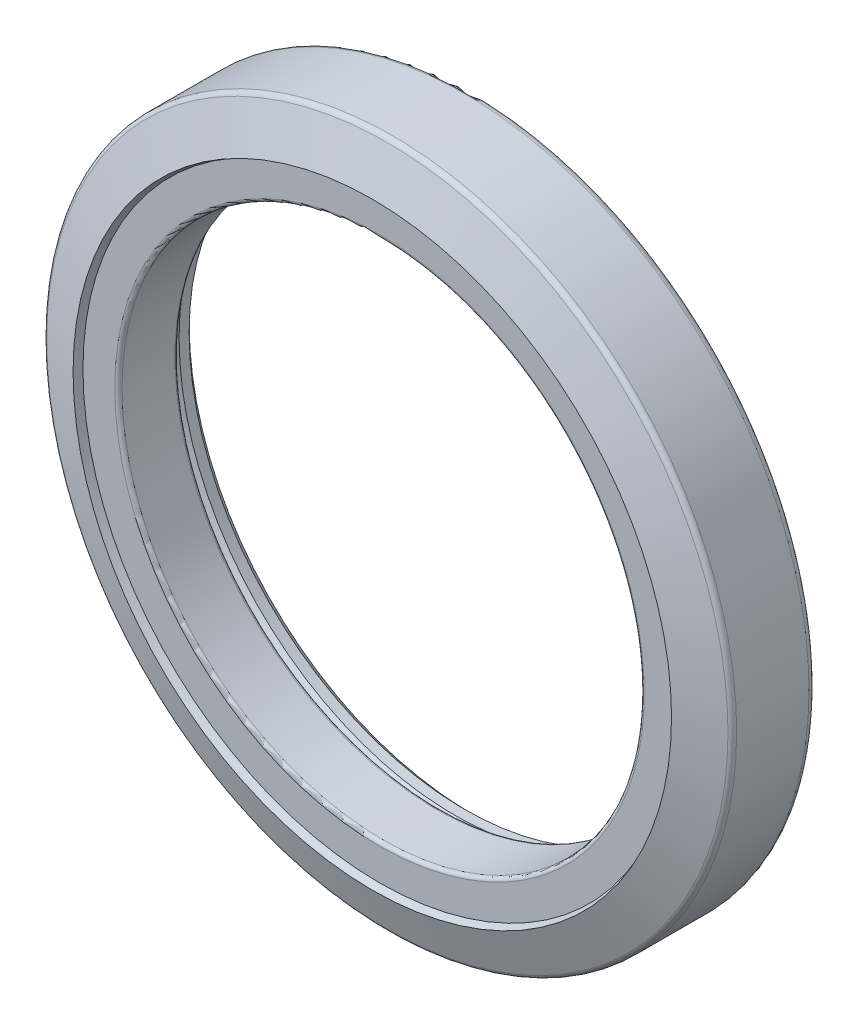
ISO-10303-21;
HEADER;
FILE_DESCRIPTION(('STEP AP214'),'2;1');
FILE_NAME('part.step','',(''),(''),'','','');
FILE_SCHEMA(('AUTOMOTIVE_DESIGN { 1 0 10303 214 1 1 1 1 }'));
ENDSEC;
DATA;
#1=APPLICATION_CONTEXT('core data for automotive mechanical design processes');
#2=APPLICATION_PROTOCOL_DEFINITION('international standard','automotive_design',2000,#1);
#3=PRODUCT_CONTEXT('',#1,'mechanical');
#4=PRODUCT('Part','Part','',(#3));
#5=PRODUCT_RELATED_PRODUCT_CATEGORY('part','',(#4));
#6=PRODUCT_DEFINITION_FORMATION('','',#4);
#7=PRODUCT_DEFINITION_CONTEXT('part definition',#1,'design');
#8=PRODUCT_DEFINITION('design','',#6,#7);
#9=PRODUCT_DEFINITION_SHAPE('','',#8);
#10=(LENGTH_UNIT() NAMED_UNIT(*) SI_UNIT(.MILLI.,.METRE.));
#11=(NAMED_UNIT(*) PLANE_ANGLE_UNIT() SI_UNIT($,.RADIAN.));
#12=(NAMED_UNIT(*) SI_UNIT($,.STERADIAN.) SOLID_ANGLE_UNIT());
#13=UNCERTAINTY_MEASURE_WITH_UNIT(LENGTH_MEASURE(1.E-05),#10,'distance_accuracy_value','');
#14=(GEOMETRIC_REPRESENTATION_CONTEXT(3) GLOBAL_UNCERTAINTY_ASSIGNED_CONTEXT((#13)) GLOBAL_UNIT_ASSIGNED_CONTEXT((#10,
#11,#12)) REPRESENTATION_CONTEXT('',''));
#15=CARTESIAN_POINT('',(0.,0.,0.));
#16=DIRECTION('',(0.,0.,1.));
#17=DIRECTION('',(1.,0.,0.));
#18=AXIS2_PLACEMENT_3D('',#15,#16,#17);
#19=CARTESIAN_POINT('',(0.,0.,-1.1811));
#20=DIRECTION('',(0.,0.,1.));
#21=DIRECTION('',(1.,0.,0.));
#22=AXIS2_PLACEMENT_3D('',#19,#20,#21);
#23=PLANE('',#22);
#24=CARTESIAN_POINT('',(0.,0.,-1.1811));
#25=DIRECTION('',(0.,0.,1.));
#26=DIRECTION('',(0.,1.,0.));
#27=AXIS2_PLACEMENT_3D('',#24,#25,#26);
#28=CIRCLE('',#27,19.304);
#29=CARTESIAN_POINT('',(0.,19.304,-1.1811));
#30=VERTEX_POINT('',#29);
#31=EDGE_CURVE('E142',#30,#30,#28,.F.);
#32=ORIENTED_EDGE('',*,*,#31,.T.);
#33=EDGE_LOOP('',(#32));
#34=FACE_BOUND('',#33,.T.);
#35=CARTESIAN_POINT('',(0.,0.,-1.1811));
#36=DIRECTION('',(0.,0.,-1.));
#37=DIRECTION('',(1.,0.,0.));
#38=AXIS2_PLACEMENT_3D('',#35,#36,#37);
#39=CIRCLE('',#38,18.4912);
#40=CARTESIAN_POINT('',(18.4912,0.,-1.1811));
#41=VERTEX_POINT('',#40);
#42=EDGE_CURVE('E173',#41,#41,#39,.T.);
#43=ORIENTED_EDGE('',*,*,#42,.F.);
#44=EDGE_LOOP('',(#43));
#45=FACE_BOUND('',#44,.T.);
#46=ADVANCED_FACE('F14',(#34,#45),#23,.F.);
#47=CARTESIAN_POINT('',(0.,0.,-0.9779));
#48=DIRECTION('',(0.,0.,1.));
#49=DIRECTION('',(1.,0.,0.));
#50=AXIS2_PLACEMENT_3D('',#47,#48,#49);
#51=TOROIDAL_SURFACE('',#50,18.4912,0.2032);
#52=CARTESIAN_POINT('',(0.,0.,-0.9779));
#53=DIRECTION('',(0.,0.,1.));
#54=DIRECTION('',(1.,0.,0.));
#55=AXIS2_PLACEMENT_3D('',#52,#53,#54);
#56=CIRCLE('',#55,18.288);
#57=CARTESIAN_POINT('',(18.288,0.,-0.9779));
#58=VERTEX_POINT('',#57);
#59=EDGE_CURVE('E137',#58,#58,#56,.T.);
#60=ORIENTED_EDGE('',*,*,#59,.T.);
#61=EDGE_LOOP('',(#60));
#62=FACE_BOUND('',#61,.T.);
#63=ORIENTED_EDGE('',*,*,#42,.T.);
#64=EDGE_LOOP('',(#63));
#65=FACE_BOUND('',#64,.T.);
#66=ADVANCED_FACE('F154',(#62,#65),#51,.T.);
#67=CARTESIAN_POINT('',(0.,0.,-1.5621));
#68=DIRECTION('',(0.,0.,1.));
#69=DIRECTION('',(1.,0.,0.));
#70=AXIS2_PLACEMENT_3D('',#67,#68,#69);
#71=TOROIDAL_SURFACE('',#70,19.304,0.381);
#72=CARTESIAN_POINT('',(0.,0.,-1.76399923967285));
#73=DIRECTION('',(0.,0.,1.));
#74=DIRECTION('',(1.,0.,0.));
#75=AXIS2_PLACEMENT_3D('',#72,#73,#74);
#76=CIRCLE('',#75,19.6271063246356);
#77=CARTESIAN_POINT('',(19.6271063246356,0.,-1.76399923967285));
#78=VERTEX_POINT('',#77);
#79=EDGE_CURVE('E129',#78,#78,#76,.F.);
#80=ORIENTED_EDGE('',*,*,#79,.T.);
#81=EDGE_LOOP('',(#80));
#82=FACE_BOUND('',#81,.T.);
#83=ORIENTED_EDGE('',*,*,#31,.F.);
#84=EDGE_LOOP('',(#83));
#85=FACE_BOUND('',#84,.T.);
#86=ADVANCED_FACE('F150',(#82,#85),#71,.F.);
#87=CARTESIAN_POINT('',(0.,0.,3.4925));
#88=DIRECTION('',(0.,0.,1.));
#89=DIRECTION('',(1.,0.,0.));
#90=AXIS2_PLACEMENT_3D('',#87,#88,#89);
#91=CYLINDRICAL_SURFACE('',#90,18.288);
#92=CARTESIAN_POINT('',(0.,0.,2.73049999999994));
#93=DIRECTION('',(0.,0.,-1.));
#94=DIRECTION('',(-1.,0.,0.));
#95=AXIS2_PLACEMENT_3D('',#92,#93,#94);
#96=CIRCLE('',#95,18.288);
#97=CARTESIAN_POINT('',(-18.288,0.,2.73049999999994));
#98=VERTEX_POINT('',#97);
#99=EDGE_CURVE('E110',#98,#98,#96,.T.);
#100=ORIENTED_EDGE('',*,*,#99,.F.);
#101=EDGE_LOOP('',(#100));
#102=FACE_BOUND('',#101,.T.);
#103=ORIENTED_EDGE('',*,*,#59,.F.);
#104=EDGE_LOOP('',(#103));
#105=FACE_BOUND('',#104,.T.);
#106=ADVANCED_FACE('F153',(#102,#105),#91,.F.);
#107=CARTESIAN_POINT('',(0.,0.,-1.76399923967285));
#108=DIRECTION('',(0.,0.,1.));
#109=DIRECTION('',(1.,0.,0.));
#110=AXIS2_PLACEMENT_3D('',#107,#108,#109);
#111=CONICAL_SURFACE('',#110,19.6271063246356,0.558505360638188);
#112=CARTESIAN_POINT('',(0.,0.,-2.28107744753874));
#113=DIRECTION('',(0.,0.,-1.));
#114=DIRECTION('',(-1.,0.,0.));
#115=AXIS2_PLACEMENT_3D('',#112,#113,#114);
#116=CIRCLE('',#115,19.304);
#117=CARTESIAN_POINT('',(-19.304,0.,-2.28107744753874));
#118=VERTEX_POINT('',#117);
#119=EDGE_CURVE('E101',#118,#118,#116,.T.);
#120=ORIENTED_EDGE('',*,*,#119,.T.);
#121=EDGE_LOOP('',(#120));
#122=FACE_BOUND('',#121,.T.);
#123=ORIENTED_EDGE('',*,*,#79,.F.);
#124=EDGE_LOOP('',(#123));
#125=FACE_BOUND('',#124,.T.);
#126=ADVANCED_FACE('F120',(#122,#125),#111,.F.);
#127=CARTESIAN_POINT('',(0.,0.,2.73049999999994));
#128=DIRECTION('',(0.,0.,-1.));
#129=DIRECTION('',(-1.,0.,0.));
#130=AXIS2_PLACEMENT_3D('',#127,#128,#129);
#131=TOROIDAL_SURFACE('',#130,18.542,0.254);
#132=ORIENTED_EDGE('',*,*,#99,.T.);
#133=EDGE_LOOP('',(#132));
#134=FACE_BOUND('',#133,.T.);
#135=CARTESIAN_POINT('',(0.,0.,2.98449999999994));
#136=DIRECTION('',(0.,0.,1.));
#137=DIRECTION('',(-1.,0.,0.));
#138=AXIS2_PLACEMENT_3D('',#135,#136,#137);
#139=CIRCLE('',#138,18.542);
#140=CARTESIAN_POINT('',(-18.542,0.,2.98449999999994));
#141=VERTEX_POINT('',#140);
#142=EDGE_CURVE('E109',#141,#141,#139,.T.);
#143=ORIENTED_EDGE('',*,*,#142,.T.);
#144=EDGE_LOOP('',(#143));
#145=FACE_BOUND('',#144,.T.);
#146=ADVANCED_FACE('F116',(#134,#145),#131,.T.);
#147=CARTESIAN_POINT('',(0.,0.,-3.4925));
#148=DIRECTION('',(0.,0.,-1.));
#149=DIRECTION('',(-1.,0.,0.));
#150=AXIS2_PLACEMENT_3D('',#147,#148,#149);
#151=CYLINDRICAL_SURFACE('',#150,19.304);
#152=ORIENTED_EDGE('',*,*,#119,.F.);
#153=EDGE_LOOP('',(#152));
#154=FACE_BOUND('',#153,.T.);
#155=CARTESIAN_POINT('',(0.,0.,-2.9845));
#156=DIRECTION('',(0.,0.,-1.));
#157=DIRECTION('',(-1.,0.,0.));
#158=AXIS2_PLACEMENT_3D('',#155,#156,#157);
#159=CIRCLE('',#158,19.304);
#160=CARTESIAN_POINT('',(-19.304,0.,-2.9845));
#161=VERTEX_POINT('',#160);
#162=EDGE_CURVE('E185',#161,#161,#159,.T.);
#163=ORIENTED_EDGE('',*,*,#162,.T.);
#164=EDGE_LOOP('',(#163));
#165=FACE_BOUND('',#164,.T.);
#166=ADVANCED_FACE('F91',(#154,#165),#151,.F.);
#167=CARTESIAN_POINT('',(0.,0.,2.98449999999994));
#168=DIRECTION('',(0.,0.,-1.));
#169=DIRECTION('',(-1.,0.,0.));
#170=AXIS2_PLACEMENT_3D('',#167,#168,#169);
#171=PLANE('',#170);
#172=CARTESIAN_POINT('',(0.,0.,2.98449999999993));
#173=DIRECTION('',(0.,0.,1.));
#174=DIRECTION('',(1.,0.,0.));
#175=AXIS2_PLACEMENT_3D('',#172,#173,#174);
#176=CIRCLE('',#175,20.7701031209927);
#177=CARTESIAN_POINT('',(20.7701031209927,0.,2.98449999999993));
#178=VERTEX_POINT('',#177);
#179=EDGE_CURVE('E18',#178,#178,#176,.T.);
#180=ORIENTED_EDGE('',*,*,#179,.T.);
#181=EDGE_LOOP('',(#180));
#182=FACE_BOUND('',#181,.T.);
#183=ORIENTED_EDGE('',*,*,#142,.F.);
#184=EDGE_LOOP('',(#183));
#185=FACE_BOUND('',#184,.T.);
#186=ADVANCED_FACE('F86',(#182,#185),#171,.F.);
#187=CARTESIAN_POINT('',(0.,0.,-3.49250000000001));
#188=DIRECTION('',(0.,0.,-1.));
#189=DIRECTION('',(-1.,0.,0.));
#190=AXIS2_PLACEMENT_3D('',#187,#188,#189);
#191=CONICAL_SURFACE('',#190,19.812,0.785398163397451);
#192=CARTESIAN_POINT('',(0.,0.,-3.4925));
#193=DIRECTION('',(0.,0.,-1.));
#194=DIRECTION('',(-1.,0.,0.));
#195=AXIS2_PLACEMENT_3D('',#192,#193,#194);
#196=CIRCLE('',#195,19.812);
#197=CARTESIAN_POINT('',(-19.812,0.,-3.4925));
#198=VERTEX_POINT('',#197);
#199=EDGE_CURVE('E60',#198,#198,#196,.F.);
#200=ORIENTED_EDGE('',*,*,#199,.F.);
#201=EDGE_LOOP('',(#200));
#202=FACE_BOUND('',#201,.T.);
#203=ORIENTED_EDGE('',*,*,#162,.F.);
#204=EDGE_LOOP('',(#203));
#205=FACE_BOUND('',#204,.T.);
#206=ADVANCED_FACE('F82',(#202,#205),#191,.F.);
#207=CARTESIAN_POINT('',(0.,0.,3.4925));
#208=DIRECTION('',(0.,0.,1.));
#209=DIRECTION('',(1.,0.,0.));
#210=AXIS2_PLACEMENT_3D('',#207,#208,#209);
#211=CONICAL_SURFACE('',#210,20.955,0.349065850398865);
#212=CARTESIAN_POINT('',(0.,0.,3.49250000000001));
#213=DIRECTION('',(0.,0.,-1.));
#214=DIRECTION('',(-1.,0.,0.));
#215=AXIS2_PLACEMENT_3D('',#212,#213,#214);
#216=CIRCLE('',#215,20.955);
#217=CARTESIAN_POINT('',(-20.955,0.,3.49250000000001));
#218=VERTEX_POINT('',#217);
#219=EDGE_CURVE('E56',#218,#218,#216,.T.);
#220=ORIENTED_EDGE('',*,*,#219,.F.);
#221=EDGE_LOOP('',(#220));
#222=FACE_BOUND('',#221,.T.);
#223=ORIENTED_EDGE('',*,*,#179,.F.);
#224=EDGE_LOOP('',(#223));
#225=FACE_BOUND('',#224,.T.);
#226=ADVANCED_FACE('F79',(#222,#225),#211,.F.);
#227=CARTESIAN_POINT('',(0.,0.,-3.4925));
#228=DIRECTION('',(0.,0.,-1.));
#229=DIRECTION('',(-1.,0.,0.));
#230=AXIS2_PLACEMENT_3D('',#227,#228,#229);
#231=PLANE('',#230);
#232=CARTESIAN_POINT('',(0.,0.,-3.4925));
#233=DIRECTION('',(0.,0.,1.));
#234=DIRECTION('',(-1.,0.,0.));
#235=AXIS2_PLACEMENT_3D('',#232,#233,#234);
#236=CIRCLE('',#235,23.5966);
#237=CARTESIAN_POINT('',(-23.5966,0.,-3.4925));
#238=VERTEX_POINT('',#237);
#239=EDGE_CURVE('E59',#238,#238,#236,.T.);
#240=ORIENTED_EDGE('',*,*,#239,.F.);
#241=EDGE_LOOP('',(#240));
#242=FACE_BOUND('',#241,.T.);
#243=ORIENTED_EDGE('',*,*,#199,.T.);
#244=EDGE_LOOP('',(#243));
#245=FACE_BOUND('',#244,.T.);
#246=ADVANCED_FACE('F70',(#242,#245),#231,.T.);
#247=CARTESIAN_POINT('',(0.,0.,2.4373831666167));
#248=DIRECTION('',(0.,0.,-1.));
#249=DIRECTION('',(-1.,0.,0.));
#250=AXIS2_PLACEMENT_3D('',#247,#248,#249);
#251=CONICAL_SURFACE('',#250,23.8539096746071,1.22173047639603);
#252=ORIENTED_EDGE('',*,*,#219,.T.);
#253=EDGE_LOOP('',(#252));
#254=FACE_BOUND('',#253,.T.);
#255=CARTESIAN_POINT('',(0.,0.,2.43738316661671));
#256=DIRECTION('',(0.,0.,-1.));
#257=DIRECTION('',(-1.,0.,0.));
#258=AXIS2_PLACEMENT_3D('',#255,#256,#257);
#259=CIRCLE('',#258,23.8539096746071);
#260=CARTESIAN_POINT('',(-23.8539096746071,0.,2.43738316661671));
#261=VERTEX_POINT('',#260);
#262=EDGE_CURVE('E27',#261,#261,#259,.T.);
#263=ORIENTED_EDGE('',*,*,#262,.F.);
#264=EDGE_LOOP('',(#263));
#265=FACE_BOUND('',#264,.T.);
#266=ADVANCED_FACE('F49',(#254,#265),#251,.T.);
#267=CARTESIAN_POINT('',(0.,0.,-2.9845));
#268=DIRECTION('',(0.,0.,-1.));
#269=DIRECTION('',(-1.,0.,0.));
#270=AXIS2_PLACEMENT_3D('',#267,#268,#269);
#271=TOROIDAL_SURFACE('',#270,23.5966,0.508);
#272=ORIENTED_EDGE('',*,*,#239,.T.);
#273=EDGE_LOOP('',(#272));
#274=FACE_BOUND('',#273,.T.);
#275=CARTESIAN_POINT('',(0.,0.,-2.9845));
#276=DIRECTION('',(0.,0.,1.));
#277=DIRECTION('',(1.,0.,0.));
#278=AXIS2_PLACEMENT_3D('',#275,#276,#277);
#279=CIRCLE('',#278,24.1046);
#280=CARTESIAN_POINT('',(24.1046,0.,-2.9845));
#281=VERTEX_POINT('',#280);
#282=EDGE_CURVE('E22',#281,#281,#279,.T.);
#283=ORIENTED_EDGE('',*,*,#282,.F.);
#284=EDGE_LOOP('',(#283));
#285=FACE_BOUND('',#284,.T.);
#286=ADVANCED_FACE('F43',(#274,#285),#271,.T.);
#287=CARTESIAN_POINT('',(0.,0.,2.07936027809728));
#288=DIRECTION('',(0.,0.,-1.));
#289=DIRECTION('',(-1.,0.,0.));
#290=AXIS2_PLACEMENT_3D('',#287,#288,#289);
#291=TOROIDAL_SURFACE('',#290,23.7236,0.381);
#292=ORIENTED_EDGE('',*,*,#262,.T.);
#293=EDGE_LOOP('',(#292));
#294=FACE_BOUND('',#293,.T.);
#295=CARTESIAN_POINT('',(0.,0.,2.07936027809728));
#296=DIRECTION('',(0.,0.,1.));
#297=DIRECTION('',(1.,0.,0.));
#298=AXIS2_PLACEMENT_3D('',#295,#296,#297);
#299=CIRCLE('',#298,24.1046);
#300=CARTESIAN_POINT('',(24.1046,0.,2.07936027809728));
#301=VERTEX_POINT('',#300);
#302=EDGE_CURVE('E10',#301,#301,#299,.F.);
#303=ORIENTED_EDGE('',*,*,#302,.F.);
#304=EDGE_LOOP('',(#303));
#305=FACE_BOUND('',#304,.T.);
#306=ADVANCED_FACE('F38',(#294,#305),#291,.T.);
#307=CARTESIAN_POINT('',(0.,0.,3.4925));
#308=DIRECTION('',(0.,0.,1.));
#309=DIRECTION('',(1.,0.,0.));
#310=AXIS2_PLACEMENT_3D('',#307,#308,#309);
#311=CYLINDRICAL_SURFACE('',#310,24.1046);
#312=ORIENTED_EDGE('',*,*,#302,.T.);
#313=EDGE_LOOP('',(#312));
#314=FACE_BOUND('',#313,.T.);
#315=ORIENTED_EDGE('',*,*,#282,.T.);
#316=EDGE_LOOP('',(#315));
#317=FACE_BOUND('',#316,.T.);
#318=ADVANCED_FACE('F42',(#314,#317),#311,.T.);
#319=CLOSED_SHELL('',(#46,#66,#86,#106,#126,#146,#166,#186,#206,#226,#246,#266,#286,#306,#318));
#320=MANIFOLD_SOLID_BREP('B1',#319);
#321=ADVANCED_BREP_SHAPE_REPRESENTATION('',(#18,#320),#14);
#322=SHAPE_DEFINITION_REPRESENTATION(#9,#321);
ENDSEC;
END-ISO-10303-21;
